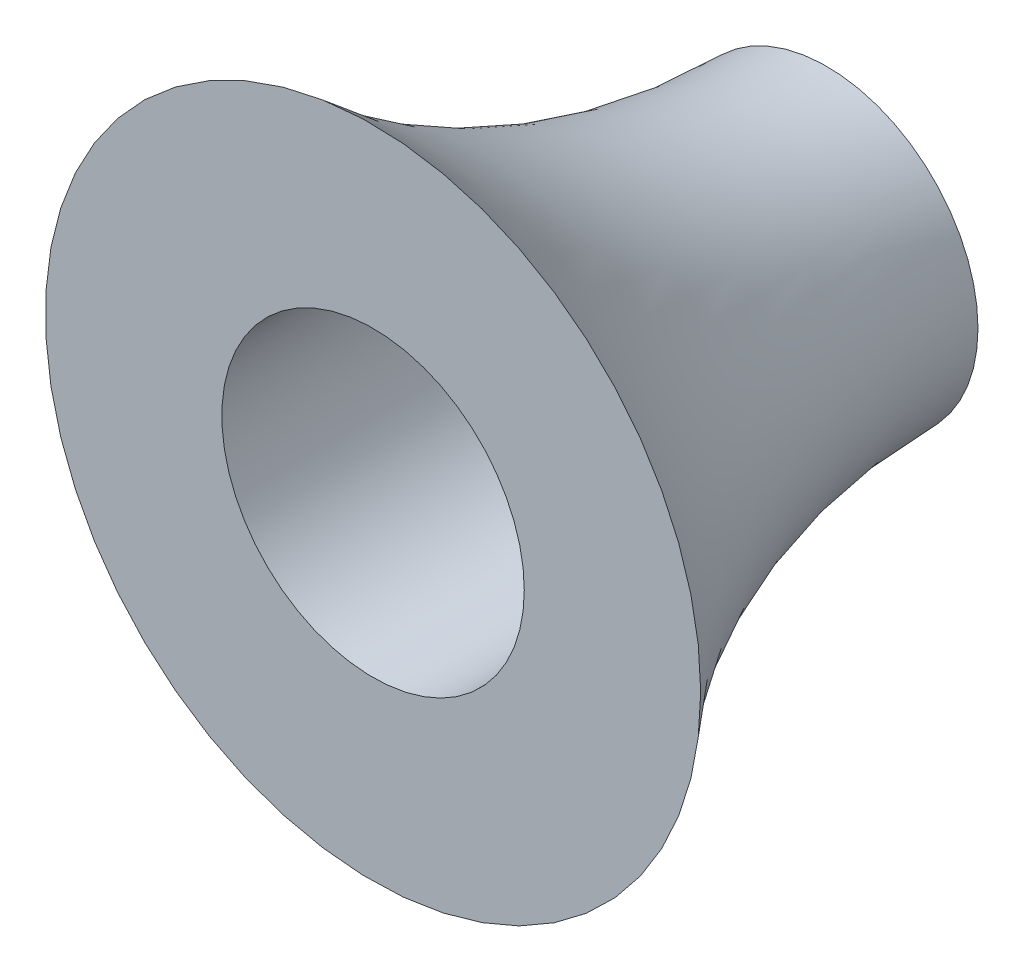
ISO-10303-21;
HEADER;
FILE_DESCRIPTION(('STEP AP214'),'2;1');
FILE_NAME('part.step','',(''),(''),'','','');
FILE_SCHEMA(('AUTOMOTIVE_DESIGN { 1 0 10303 214 1 1 1 1 }'));
ENDSEC;
DATA;
#1=APPLICATION_CONTEXT('core data for automotive mechanical design processes');
#2=APPLICATION_PROTOCOL_DEFINITION('international standard','automotive_design',2000,#1);
#3=PRODUCT_CONTEXT('',#1,'mechanical');
#4=PRODUCT('Part','Part','',(#3));
#5=PRODUCT_RELATED_PRODUCT_CATEGORY('part','',(#4));
#6=PRODUCT_DEFINITION_FORMATION('','',#4);
#7=PRODUCT_DEFINITION_CONTEXT('part definition',#1,'design');
#8=PRODUCT_DEFINITION('design','',#6,#7);
#9=PRODUCT_DEFINITION_SHAPE('','',#8);
#10=(LENGTH_UNIT() NAMED_UNIT(*) SI_UNIT(.MILLI.,.METRE.));
#11=(NAMED_UNIT(*) PLANE_ANGLE_UNIT() SI_UNIT($,.RADIAN.));
#12=(NAMED_UNIT(*) SI_UNIT($,.STERADIAN.) SOLID_ANGLE_UNIT());
#13=UNCERTAINTY_MEASURE_WITH_UNIT(LENGTH_MEASURE(1.E-05),#10,'distance_accuracy_value','');
#14=(GEOMETRIC_REPRESENTATION_CONTEXT(3) GLOBAL_UNCERTAINTY_ASSIGNED_CONTEXT((#13)) GLOBAL_UNIT_ASSIGNED_CONTEXT((#10,
#11,#12)) REPRESENTATION_CONTEXT('',''));
#15=CARTESIAN_POINT('',(0.,0.,0.));
#16=DIRECTION('',(0.,0.,1.));
#17=DIRECTION('',(1.,0.,0.));
#18=AXIS2_PLACEMENT_3D('',#15,#16,#17);
#19=CARTESIAN_POINT('',(-7.00805526532028,-5.08305526532028,-7.02));
#20=DIRECTION('',(0.,0.,1.));
#21=DIRECTION('',(1.,0.,0.));
#22=AXIS2_PLACEMENT_3D('',#19,#20,#21);
#23=PLANE('',#22);
#24=CARTESIAN_POINT('',(-6.125,-4.2,-7.02));
#25=DIRECTION('',(0.,0.,1.));
#26=DIRECTION('',(1.,0.,0.));
#27=AXIS2_PLACEMENT_3D('',#24,#25,#26);
#28=CIRCLE('',#27,0.299999999999998);
#29=CARTESIAN_POINT('',(-5.825,-4.2,-7.02));
#30=VERTEX_POINT('',#29);
#31=EDGE_CURVE('E19',#30,#30,#28,.T.);
#32=ORIENTED_EDGE('',*,*,#31,.F.);
#33=EDGE_LOOP('',(#32));
#34=FACE_BOUND('',#33,.T.);
#35=CARTESIAN_POINT('',(-6.125,-4.2,-7.01999999999981));
#36=DIRECTION('',(0.,0.,1.));
#37=DIRECTION('',(1.,0.,0.));
#38=AXIS2_PLACEMENT_3D('',#35,#36,#37);
#39=CIRCLE('',#38,0.650000000001199);
#40=CARTESIAN_POINT('',(-5.4749999999988,-4.2,-7.01999999999981));
#41=VERTEX_POINT('',#40);
#42=EDGE_CURVE('E23',#41,#41,#39,.F.);
#43=ORIENTED_EDGE('',*,*,#42,.F.);
#44=EDGE_LOOP('',(#43));
#45=FACE_BOUND('',#44,.T.);
#46=ADVANCED_FACE('F15',(#34,#45),#23,.T.);
#47=CARTESIAN_POINT('',(-6.125,-4.2,-7.92));
#48=DIRECTION('',(0.,0.,1.));
#49=DIRECTION('',(1.,0.,0.));
#50=AXIS2_PLACEMENT_3D('',#47,#48,#49);
#51=CYLINDRICAL_SURFACE('',#50,0.299999999999998);
#52=ORIENTED_EDGE('',*,*,#31,.T.);
#53=EDGE_LOOP('',(#52));
#54=FACE_BOUND('',#53,.T.);
#55=CARTESIAN_POINT('',(-6.125,-4.2,-7.92));
#56=DIRECTION('',(0.,0.,1.));
#57=DIRECTION('',(1.,0.,0.));
#58=AXIS2_PLACEMENT_3D('',#55,#56,#57);
#59=CIRCLE('',#58,0.299999999999998);
#60=CARTESIAN_POINT('',(-5.825,-4.2,-7.92));
#61=VERTEX_POINT('',#60);
#62=EDGE_CURVE('E10',#61,#61,#59,.T.);
#63=ORIENTED_EDGE('',*,*,#62,.F.);
#64=EDGE_LOOP('',(#63));
#65=FACE_BOUND('',#64,.T.);
#66=ADVANCED_FACE('F33',(#54,#65),#51,.F.);
#67=CARTESIAN_POINT('',(-6.125,-4.2,-7.92));
#68=DIRECTION('',(0.,0.,1.));
#69=DIRECTION('',(1.,0.,0.));
#70=AXIS2_PLACEMENT_3D('',#67,#68,#69);
#71=TOROIDAL_SURFACE('',#70,1.63214285713999,1.33214285713999);
#72=ORIENTED_EDGE('',*,*,#62,.T.);
#73=EDGE_LOOP('',(#72));
#74=FACE_BOUND('',#73,.T.);
#75=ORIENTED_EDGE('',*,*,#42,.T.);
#76=EDGE_LOOP('',(#75));
#77=FACE_BOUND('',#76,.T.);
#78=ADVANCED_FACE('F17',(#74,#77),#71,.F.);
#79=CLOSED_SHELL('',(#46,#66,#78));
#80=MANIFOLD_SOLID_BREP('B1',#79);
#81=ADVANCED_BREP_SHAPE_REPRESENTATION('',(#18,#80),#14);
#82=SHAPE_DEFINITION_REPRESENTATION(#9,#81);
ENDSEC;
END-ISO-10303-21;
